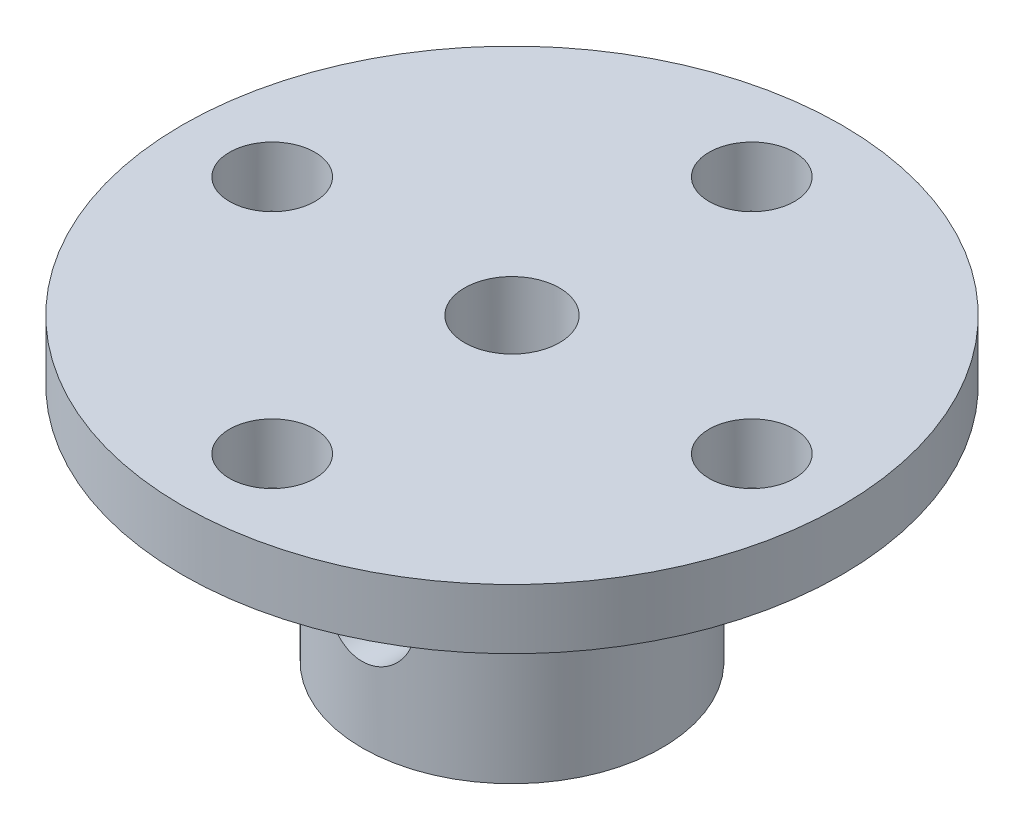
ISO-10303-21;
HEADER;
FILE_DESCRIPTION(('STEP AP214'),'2;1');
FILE_NAME('part.step','',(''),(''),'','','');
FILE_SCHEMA(('AUTOMOTIVE_DESIGN { 1 0 10303 214 1 1 1 1 }'));
ENDSEC;
DATA;
#1=APPLICATION_CONTEXT('core data for automotive mechanical design processes');
#2=APPLICATION_PROTOCOL_DEFINITION('international standard','automotive_design',2000,#1);
#3=PRODUCT_CONTEXT('',#1,'mechanical');
#4=PRODUCT('Part','Part','',(#3));
#5=PRODUCT_RELATED_PRODUCT_CATEGORY('part','',(#4));
#6=PRODUCT_DEFINITION_FORMATION('','',#4);
#7=PRODUCT_DEFINITION_CONTEXT('part definition',#1,'design');
#8=PRODUCT_DEFINITION('design','',#6,#7);
#9=PRODUCT_DEFINITION_SHAPE('','',#8);
#10=(LENGTH_UNIT() NAMED_UNIT(*) SI_UNIT(.MILLI.,.METRE.));
#11=(NAMED_UNIT(*) PLANE_ANGLE_UNIT() SI_UNIT($,.RADIAN.));
#12=(NAMED_UNIT(*) SI_UNIT($,.STERADIAN.) SOLID_ANGLE_UNIT());
#13=UNCERTAINTY_MEASURE_WITH_UNIT(LENGTH_MEASURE(1.E-05),#10,'distance_accuracy_value','');
#14=(GEOMETRIC_REPRESENTATION_CONTEXT(3) GLOBAL_UNCERTAINTY_ASSIGNED_CONTEXT((#13)) GLOBAL_UNIT_ASSIGNED_CONTEXT((#10,
#11,#12)) REPRESENTATION_CONTEXT('',''));
#15=CARTESIAN_POINT('',(0.,0.,0.));
#16=DIRECTION('',(0.,0.,1.));
#17=DIRECTION('',(1.,0.,0.));
#18=AXIS2_PLACEMENT_3D('',#15,#16,#17);
#19=CARTESIAN_POINT('',(0.,2.,0.));
#20=DIRECTION('',(0.,-1.,0.));
#21=DIRECTION('',(0.,0.,-1.));
#22=AXIS2_PLACEMENT_3D('',#19,#20,#21);
#23=CYLINDRICAL_SURFACE('',#22,11.);
#24=CARTESIAN_POINT('',(0.,2.,0.));
#25=DIRECTION('',(0.,1.,0.));
#26=DIRECTION('',(0.,0.,1.));
#27=AXIS2_PLACEMENT_3D('',#24,#25,#26);
#28=CIRCLE('',#27,11.);
#29=CARTESIAN_POINT('',(0.,2.,11.));
#30=VERTEX_POINT('',#29);
#31=EDGE_CURVE('E10',#30,#30,#28,.T.);
#32=ORIENTED_EDGE('',*,*,#31,.F.);
#33=EDGE_LOOP('',(#32));
#34=FACE_BOUND('',#33,.T.);
#35=CARTESIAN_POINT('',(0.,0.,0.));
#36=DIRECTION('',(0.,1.,0.));
#37=DIRECTION('',(0.,0.,1.));
#38=AXIS2_PLACEMENT_3D('',#35,#36,#37);
#39=CIRCLE('',#38,11.);
#40=CARTESIAN_POINT('',(0.,0.,11.));
#41=VERTEX_POINT('',#40);
#42=EDGE_CURVE('E46',#41,#41,#39,.T.);
#43=ORIENTED_EDGE('',*,*,#42,.T.);
#44=EDGE_LOOP('',(#43));
#45=FACE_BOUND('',#44,.T.);
#46=ADVANCED_FACE('F34',(#34,#45),#23,.T.);
#47=CARTESIAN_POINT('',(0.,2.,0.));
#48=DIRECTION('',(0.,1.,0.));
#49=DIRECTION('',(0.,0.,1.));
#50=AXIS2_PLACEMENT_3D('',#47,#48,#49);
#51=PLANE('',#50);
#52=CARTESIAN_POINT('',(-8.,2.,0.));
#53=DIRECTION('',(0.,1.,0.));
#54=DIRECTION('',(1.,0.,0.));
#55=AXIS2_PLACEMENT_3D('',#52,#53,#54);
#56=CIRCLE('',#55,1.425);
#57=CARTESIAN_POINT('',(-6.575,2.,0.));
#58=VERTEX_POINT('',#57);
#59=EDGE_CURVE('E237',#58,#58,#56,.T.);
#60=ORIENTED_EDGE('',*,*,#59,.F.);
#61=EDGE_LOOP('',(#60));
#62=FACE_BOUND('',#61,.T.);
#63=CARTESIAN_POINT('',(0.,2.,8.));
#64=DIRECTION('',(0.,1.,0.));
#65=DIRECTION('',(0.,0.,-1.));
#66=AXIS2_PLACEMENT_3D('',#63,#64,#65);
#67=CIRCLE('',#66,1.425);
#68=CARTESIAN_POINT('',(0.,2.,6.575));
#69=VERTEX_POINT('',#68);
#70=EDGE_CURVE('E230',#69,#69,#67,.T.);
#71=ORIENTED_EDGE('',*,*,#70,.F.);
#72=EDGE_LOOP('',(#71));
#73=FACE_BOUND('',#72,.T.);
#74=CARTESIAN_POINT('',(8.,2.,0.));
#75=DIRECTION('',(0.,1.,0.));
#76=DIRECTION('',(-1.,0.,0.));
#77=AXIS2_PLACEMENT_3D('',#74,#75,#76);
#78=CIRCLE('',#77,1.425);
#79=CARTESIAN_POINT('',(6.575,2.,0.));
#80=VERTEX_POINT('',#79);
#81=EDGE_CURVE('E231',#80,#80,#78,.T.);
#82=ORIENTED_EDGE('',*,*,#81,.F.);
#83=EDGE_LOOP('',(#82));
#84=FACE_BOUND('',#83,.T.);
#85=CARTESIAN_POINT('',(0.,2.,-8.));
#86=DIRECTION('',(0.,1.,0.));
#87=DIRECTION('',(0.,0.,1.));
#88=AXIS2_PLACEMENT_3D('',#85,#86,#87);
#89=CIRCLE('',#88,1.425);
#90=CARTESIAN_POINT('',(0.,2.,-6.575));
#91=VERTEX_POINT('',#90);
#92=EDGE_CURVE('E208',#91,#91,#89,.T.);
#93=ORIENTED_EDGE('',*,*,#92,.F.);
#94=EDGE_LOOP('',(#93));
#95=FACE_BOUND('',#94,.T.);
#96=CARTESIAN_POINT('',(0.,2.,0.));
#97=DIRECTION('',(0.,-1.,0.));
#98=DIRECTION('',(0.,0.,-1.));
#99=AXIS2_PLACEMENT_3D('',#96,#97,#98);
#100=CIRCLE('',#99,1.585);
#101=CARTESIAN_POINT('',(0.,2.,-1.585));
#102=VERTEX_POINT('',#101);
#103=EDGE_CURVE('E202',#102,#102,#100,.T.);
#104=ORIENTED_EDGE('',*,*,#103,.T.);
#105=EDGE_LOOP('',(#104));
#106=FACE_BOUND('',#105,.T.);
#107=ORIENTED_EDGE('',*,*,#31,.T.);
#108=EDGE_LOOP('',(#107));
#109=FACE_BOUND('',#108,.T.);
#110=ADVANCED_FACE('F96',(#62,#73,#84,#95,#106,#109),#51,.T.);
#111=CARTESIAN_POINT('',(0.,0.,0.));
#112=DIRECTION('',(0.,1.,0.));
#113=DIRECTION('',(0.,0.,1.));
#114=AXIS2_PLACEMENT_3D('',#111,#112,#113);
#115=PLANE('',#114);
#116=CARTESIAN_POINT('',(-8.,0.,0.));
#117=DIRECTION('',(0.,1.,0.));
#118=DIRECTION('',(0.,0.,1.));
#119=AXIS2_PLACEMENT_3D('',#116,#117,#118);
#120=CIRCLE('',#119,1.425);
#121=CARTESIAN_POINT('',(-8.,0.,1.42500000000003));
#122=VERTEX_POINT('',#121);
#123=EDGE_CURVE('E226',#122,#122,#120,.F.);
#124=ORIENTED_EDGE('',*,*,#123,.F.);
#125=EDGE_LOOP('',(#124));
#126=FACE_BOUND('',#125,.T.);
#127=CARTESIAN_POINT('',(0.,0.,8.));
#128=DIRECTION('',(0.,1.,0.));
#129=DIRECTION('',(0.,0.,1.));
#130=AXIS2_PLACEMENT_3D('',#127,#128,#129);
#131=CIRCLE('',#130,1.425);
#132=CARTESIAN_POINT('',(0.,0.,9.425));
#133=VERTEX_POINT('',#132);
#134=EDGE_CURVE('E234',#133,#133,#131,.F.);
#135=ORIENTED_EDGE('',*,*,#134,.F.);
#136=EDGE_LOOP('',(#135));
#137=FACE_BOUND('',#136,.T.);
#138=CARTESIAN_POINT('',(8.,0.,0.));
#139=DIRECTION('',(0.,1.,0.));
#140=DIRECTION('',(0.,0.,1.));
#141=AXIS2_PLACEMENT_3D('',#138,#139,#140);
#142=CIRCLE('',#141,1.425);
#143=CARTESIAN_POINT('',(8.,0.,1.42499999999992));
#144=VERTEX_POINT('',#143);
#145=EDGE_CURVE('E227',#144,#144,#142,.F.);
#146=ORIENTED_EDGE('',*,*,#145,.F.);
#147=EDGE_LOOP('',(#146));
#148=FACE_BOUND('',#147,.T.);
#149=CARTESIAN_POINT('',(0.,0.,-8.));
#150=DIRECTION('',(0.,1.,0.));
#151=DIRECTION('',(0.,0.,1.));
#152=AXIS2_PLACEMENT_3D('',#149,#150,#151);
#153=CIRCLE('',#152,1.425);
#154=CARTESIAN_POINT('',(0.,0.,-6.575));
#155=VERTEX_POINT('',#154);
#156=EDGE_CURVE('E204',#155,#155,#153,.F.);
#157=ORIENTED_EDGE('',*,*,#156,.F.);
#158=EDGE_LOOP('',(#157));
#159=FACE_BOUND('',#158,.T.);
#160=CARTESIAN_POINT('',(0.,0.,0.));
#161=DIRECTION('',(0.,1.,0.));
#162=DIRECTION('',(0.,0.,1.));
#163=AXIS2_PLACEMENT_3D('',#160,#161,#162);
#164=CIRCLE('',#163,5.);
#165=CARTESIAN_POINT('',(0.,0.,5.));
#166=VERTEX_POINT('',#165);
#167=EDGE_CURVE('E54',#166,#166,#164,.T.);
#168=ORIENTED_EDGE('',*,*,#167,.T.);
#169=EDGE_LOOP('',(#168));
#170=FACE_BOUND('',#169,.T.);
#171=ORIENTED_EDGE('',*,*,#42,.F.);
#172=EDGE_LOOP('',(#171));
#173=FACE_BOUND('',#172,.T.);
#174=ADVANCED_FACE('F94',(#126,#137,#148,#159,#170,#173),#115,.F.);
#175=CARTESIAN_POINT('',(0.,-8.,0.));
#176=DIRECTION('',(0.,1.,0.));
#177=DIRECTION('',(0.,0.,1.));
#178=AXIS2_PLACEMENT_3D('',#175,#176,#177);
#179=CYLINDRICAL_SURFACE('',#178,5.);
#180=CARTESIAN_POINT('',(0.,-5.5,5.));
#181=CARTESIAN_POINT('',(0.0822886127532999,-5.49999900251511,4.9999992925055));
#182=CARTESIAN_POINT('',(0.164587318351529,-5.49320613637603,4.99794915693954));
#183=CARTESIAN_POINT('',(0.326788125304881,-5.4662786457779,4.98997105593691));
#184=CARTESIAN_POINT('',(0.40668950441142,-5.44614004197666,4.98404193389692));
#185=CARTESIAN_POINT('',(0.561732707754526,-5.39325398308974,4.96895552501836));
#186=CARTESIAN_POINT('',(0.636881364395373,-5.36052513038106,4.95980300250425));
#187=CARTESIAN_POINT('',(0.780624181053131,-5.28346390694416,4.93922109237645));
#188=CARTESIAN_POINT('',(0.849217467469669,-5.23912999260458,4.92779140192067));
#189=CARTESIAN_POINT('',(0.979871797183745,-5.13877599252733,4.90350737192774));
#190=CARTESIAN_POINT('',(1.04171807124434,-5.08248337411409,4.89062383657036));
#191=CARTESIAN_POINT('',(1.15524920923324,-4.96039077008982,4.86505834210442));
#192=CARTESIAN_POINT('',(1.20693236327441,-4.89458918787504,4.85237641724501));
#193=CARTESIAN_POINT('',(1.29980037723708,-4.75352924696239,4.82834113993772));
#194=CARTESIAN_POINT('',(1.34072309022214,-4.67809153900926,4.81702406663875));
#195=CARTESIAN_POINT('',(1.4092139477476,-4.52101074576971,4.79743620394031));
#196=CARTESIAN_POINT('',(1.43678529919973,-4.43936915607203,4.78916468313311));
#197=CARTESIAN_POINT('',(1.47701633682652,-4.27460973386954,4.77690870838434));
#198=CARTESIAN_POINT('',(1.49007196234677,-4.19159725613606,4.77281069324533));
#199=CARTESIAN_POINT('',(1.50213730614672,-4.02446684378323,4.76902789749767));
#200=CARTESIAN_POINT('',(1.50115042761078,-3.94034918194091,4.76934204760571));
#201=CARTESIAN_POINT('',(1.48546977199812,-3.77661609139152,4.77424744067778));
#202=CARTESIAN_POINT('',(1.47127205262685,-3.69694774963776,4.7786838859914));
#203=CARTESIAN_POINT('',(1.43037420427056,-3.54118021372654,4.79108356228624));
#204=CARTESIAN_POINT('',(1.40367284141641,-3.46508137262567,4.79904714132351));
#205=CARTESIAN_POINT('',(1.33816026653682,-3.31739965033926,4.81772733074973));
#206=CARTESIAN_POINT('',(1.29918816934643,-3.24589291604474,4.82848016115952));
#207=CARTESIAN_POINT('',(1.21035222588683,-3.11026797798981,4.85150987000065));
#208=CARTESIAN_POINT('',(1.16048574002588,-3.04615157058622,4.86378711746991));
#209=CARTESIAN_POINT('',(1.04881290765546,-2.92431380923798,4.88911011297937));
#210=CARTESIAN_POINT('',(0.986594907466973,-2.86697133597033,4.90216654310498));
#211=CARTESIAN_POINT('',(0.853263259313967,-2.76344601593575,4.92712244063259));
#212=CARTESIAN_POINT('',(0.782149051860888,-2.71726387158557,4.9390218351841));
#213=CARTESIAN_POINT('',(0.632355038342803,-2.63714007753527,4.9604316006947));
#214=CARTESIAN_POINT('',(0.55362774974795,-2.60328248375014,4.96992543668314));
#215=CARTESIAN_POINT('',(0.391245415603519,-2.54940040990037,4.98533521832222));
#216=CARTESIAN_POINT('',(0.307591751589581,-2.52937207146751,4.99125216186999));
#217=CARTESIAN_POINT('',(0.140952242668331,-2.50434782210061,4.99868364643538));
#218=CARTESIAN_POINT('',(0.0580500976011868,-2.49883841419839,5.0003485041779));
#219=CARTESIAN_POINT('',(-0.107499605823383,-2.50156915571208,4.9995292324176));
#220=CARTESIAN_POINT('',(-0.190147196690781,-2.50980746965144,4.99704565677756));
#221=CARTESIAN_POINT('',(-0.350903605309697,-2.5393846111115,4.98830696987163));
#222=CARTESIAN_POINT('',(-0.42907277261417,-2.56042338758087,4.98213829799417));
#223=CARTESIAN_POINT('',(-0.580754638954523,-2.6146432327782,4.96674347841533));
#224=CARTESIAN_POINT('',(-0.654266777025584,-2.64782576103786,4.95751696321085));
#225=CARTESIAN_POINT('',(-0.796437189461053,-2.72625316548113,4.93669654351325));
#226=CARTESIAN_POINT('',(-0.86494382619967,-2.77175934094797,4.92505280829675));
#227=CARTESIAN_POINT('',(-0.993523307980147,-2.87322475405281,4.90073468764318));
#228=CARTESIAN_POINT('',(-1.05359403235594,-2.92918661188767,4.8880600443108));
#229=CARTESIAN_POINT('',(-1.16585744551027,-3.05238730836935,4.86253171869138));
#230=CARTESIAN_POINT('',(-1.21768481231504,-3.11996187577174,4.84968825033268));
#231=CARTESIAN_POINT('',(-1.30928995072154,-3.26312793901353,4.82576515238463));
#232=CARTESIAN_POINT('',(-1.34906803829472,-3.33871922455821,4.81468547654651));
#233=CARTESIAN_POINT('',(-1.41517347127168,-3.49553249125469,4.79567189615055));
#234=CARTESIAN_POINT('',(-1.4415634693705,-3.57672618653659,4.78772337843827));
#235=CARTESIAN_POINT('',(-1.48021730815114,-3.74268796893148,4.77591594362794));
#236=CARTESIAN_POINT('',(-1.49248598978779,-3.82745482078767,4.772055625083));
#237=CARTESIAN_POINT('',(-1.50221984485059,-3.99436151837623,4.76899972496087));
#238=CARTESIAN_POINT('',(-1.5002805530849,-4.07646365101759,4.76961647442754));
#239=CARTESIAN_POINT('',(-1.48307505444813,-4.2391141033728,4.77499401288294));
#240=CARTESIAN_POINT('',(-1.46780938124716,-4.31966248517635,4.77975463592551));
#241=CARTESIAN_POINT('',(-1.42476888804136,-4.47594539914285,4.79275763670386));
#242=CARTESIAN_POINT('',(-1.39715175507069,-4.55172728736169,4.80095604545965));
#243=CARTESIAN_POINT('',(-1.33031507121129,-4.69764243881772,4.81990278909136));
#244=CARTESIAN_POINT('',(-1.29109329962876,-4.76777461764076,4.83065161194312));
#245=CARTESIAN_POINT('',(-1.20048763805072,-4.90316311652711,4.85397676425833));
#246=CARTESIAN_POINT('',(-1.14871276092994,-4.96814876126041,4.86660540163798));
#247=CARTESIAN_POINT('',(-1.03517434629782,-5.08870249830786,4.89201320450026));
#248=CARTESIAN_POINT('',(-0.973408217134502,-5.14426813946776,4.90479240823905));
#249=CARTESIAN_POINT('',(-0.839465762183248,-5.24602341229503,4.92950936570649));
#250=CARTESIAN_POINT('',(-0.767037885790607,-5.29189144685549,4.94141159765674));
#251=CARTESIAN_POINT('',(-0.615141373983529,-5.37073516990403,4.96260680455813));
#252=CARTESIAN_POINT('',(-0.535676052998954,-5.40371688827451,4.97190099931066));
#253=CARTESIAN_POINT('',(-0.38075771265528,-5.45289527565275,4.98602174969301));
#254=CARTESIAN_POINT('',(-0.305786961954233,-5.47051167288325,4.99122027381068));
#255=CARTESIAN_POINT('',(-0.153880195230778,-5.49406352524158,4.99820944494492));
#256=CARTESIAN_POINT('',(-0.0769445098581391,-5.50000093270482,5.0000006615474));
#257=CARTESIAN_POINT('',(0.,-5.5,5.));
#258=B_SPLINE_CURVE_WITH_KNOTS('',3,(#180,#181,#182,#183,#184,#185,#186,#187,#188,#189,#190,
#191,#192,#193,#194,#195,#196,#197,#198,#199,#200,#201,#202,#203,#204,#205,#206,#207,#208,#209,
#210,#211,#212,#213,#214,#215,#216,#217,#218,#219,#220,#221,#222,#223,#224,#225,#226,#227,#228,
#229,#230,#231,#232,#233,#234,#235,#236,#237,#238,#239,#240,#241,#242,#243,#244,#245,#246,#247,
#248,#249,#250,#251,#252,#253,#254,#255,#256,#257),.UNSPECIFIED.,.T.,.F.,(4,2,2,2,2,2,2,2,2,2,2,
2,2,2,2,2,2,2,2,2,2,2,2,2,2,2,2,2,2,2,2,2,2,2,2,2,2,2,4),(0.,0.246583203612611,0.493239964846,
0.739533676300874,0.985860164412702,1.23855602948191,1.49129437288633,1.74971481004109,
2.00807314543224,2.25919689356599,2.51025978319089,2.75226016697676,2.99428443658001,
3.2396242644712,3.48502360158556,3.74067104048167,3.99633456531072,4.25371046881689,
4.51101453528808,4.75908809438545,5.00712853550327,5.24956746682327,5.49203554593729,
5.74011305702909,5.98825282000191,6.24540400322819,6.50254844252681,6.75847814951252,
7.01432009460283,7.25950155466943,7.504673196616,7.74680040402721,7.98897397553107,
8.23996925679931,8.49102974897503,8.74942996156671,9.00770911595236,9.2383169193046,
9.46888616948875),.UNSPECIFIED.);
#259=CARTESIAN_POINT('',(0.,-5.5,5.));
#260=VERTEX_POINT('',#259);
#261=EDGE_CURVE('E84',#260,#260,#258,.T.);
#262=ORIENTED_EDGE('',*,*,#261,.F.);
#263=EDGE_LOOP('',(#262));
#264=FACE_BOUND('',#263,.T.);
#265=CARTESIAN_POINT('',(1.5,-4.,-4.76969600708473));
#266=CARTESIAN_POINT('',(1.49999897633764,-4.0821945479424,-4.7696968572698));
#267=CARTESIAN_POINT('',(1.49322108167142,-4.16439922414402,-4.77184390209069));
#268=CARTESIAN_POINT('',(1.46635844446749,-4.32640524959194,-4.780165783029));
#269=CARTESIAN_POINT('',(1.44626925573578,-4.40620578650147,-4.78634196493468));
#270=CARTESIAN_POINT('',(1.39352753269955,-4.56103472827173,-4.80196102485632));
#271=CARTESIAN_POINT('',(1.36089589394243,-4.63607082963309,-4.81139846703232));
#272=CARTESIAN_POINT('',(1.28406421917929,-4.7796219339953,-4.83246932547567));
#273=CARTESIAN_POINT('',(1.23986245137053,-4.84813595868444,-4.84410307041019));
#274=CARTESIAN_POINT('',(1.13964754141627,-4.97886639057737,-4.86866862185765));
#275=CARTESIAN_POINT('',(1.08333207175807,-5.04084589794629,-4.88162808311636));
#276=CARTESIAN_POINT('',(0.961136237579599,-5.15463795132251,-4.90714861936757));
#277=CARTESIAN_POINT('',(0.895254645461112,-5.20644919044988,-4.91970964297705));
#278=CARTESIAN_POINT('',(0.75411143779369,-5.29946269983331,-4.94333214579389));
#279=CARTESIAN_POINT('',(0.678684021335815,-5.34042342444281,-4.95435724342404));
#280=CARTESIAN_POINT('',(0.521624645369354,-5.40898725904276,-4.97334435920684));
#281=CARTESIAN_POINT('',(0.439994028387912,-5.43659324985745,-4.98130703789495));
#282=CARTESIAN_POINT('',(0.27532385263083,-5.47688000109051,-4.99307646003589));
#283=CARTESIAN_POINT('',(0.192391398953801,-5.4899651276527,-4.99699557369338));
#284=CARTESIAN_POINT('',(0.0254218237493148,-5.50211732464644,-5.00063201501348));
#285=CARTESIAN_POINT('',(-0.0586150620503685,-5.50118733940196,-5.00035022521079));
#286=CARTESIAN_POINT('',(-0.22257115660016,-5.48560713145698,-4.99569603817659));
#287=CARTESIAN_POINT('',(-0.302536267641342,-5.47139480619013,-4.9914542020526));
#288=CARTESIAN_POINT('',(-0.458889213442527,-5.43036866400571,-4.97951522112593));
#289=CARTESIAN_POINT('',(-0.535276821322846,-5.40355404905733,-4.97181785750586));
#290=CARTESIAN_POINT('',(-0.683347326351281,-5.33778797658144,-4.95365220986963));
#291=CARTESIAN_POINT('',(-0.754965064694478,-5.29869879719273,-4.94315269676706));
#292=CARTESIAN_POINT('',(-0.890764673783156,-5.20960214757177,-4.92049640648069));
#293=CARTESIAN_POINT('',(-0.954944774872131,-5.15959208703652,-4.90833923637778));
#294=CARTESIAN_POINT('',(-1.0766604815298,-5.0478022492484,-4.88311550488165));
#295=CARTESIAN_POINT('',(-1.13384458040111,-4.98564308097026,-4.87003195321461));
#296=CARTESIAN_POINT('',(-1.23707651539824,-4.85248998210995,-4.84483979887497));
#297=CARTESIAN_POINT('',(-1.28312324482853,-4.78149517461077,-4.8327312931702));
#298=CARTESIAN_POINT('',(-1.3631399533545,-4.63176053075101,-4.81077903197678));
#299=CARTESIAN_POINT('',(-1.39698989237679,-4.55295295413708,-4.80095810695957));
#300=CARTESIAN_POINT('',(-1.45083362878413,-4.39039279155446,-4.78496392548436));
#301=CARTESIAN_POINT('',(-1.4708319464056,-4.30664182846544,-4.7787894791583));
#302=CARTESIAN_POINT('',(-1.49574770282165,-4.13991763926072,-4.77104849541241));
#303=CARTESIAN_POINT('',(-1.50119946380212,-4.05703177610602,-4.7693187867044));
#304=CARTESIAN_POINT('',(-1.49835947233062,-3.89152709999013,-4.77021192441924));
#305=CARTESIAN_POINT('',(-1.4900696437133,-3.80890825126915,-4.77283416156589));
#306=CARTESIAN_POINT('',(-1.4604576357419,-3.64851162202913,-4.78197558554912));
#307=CARTESIAN_POINT('',(-1.4394796143128,-3.57066383573648,-4.78839176507489));
#308=CARTESIAN_POINT('',(-1.3854857774794,-3.41959830918508,-4.80429141231227));
#309=CARTESIAN_POINT('',(-1.3524681034276,-3.34638128585943,-4.81377535359073));
#310=CARTESIAN_POINT('',(-1.274318711965,-3.20448253592787,-4.83505835023047));
#311=CARTESIAN_POINT('',(-1.22888564172729,-3.13597527901421,-4.84691271069799));
#312=CARTESIAN_POINT('',(-1.12755301600385,-3.0073618938192,-4.87148205646987));
#313=CARTESIAN_POINT('',(-1.07165095534897,-2.94725778238721,-4.88419724730003));
#314=CARTESIAN_POINT('',(-0.9484551324936,-2.83481959418526,-4.90963633548158));
#315=CARTESIAN_POINT('',(-0.880811065857435,-2.78286437101302,-4.92234245063004));
#316=CARTESIAN_POINT('',(-0.73746178459025,-2.69103329897225,-4.94584851748651));
#317=CARTESIAN_POINT('',(-0.661756970543945,-2.65115685021854,-4.95664856384717));
#318=CARTESIAN_POINT('',(-0.504935504705223,-2.5849999694317,-4.97505970474957));
#319=CARTESIAN_POINT('',(-0.42386462203784,-2.55861798384102,-4.98269453424966));
#320=CARTESIAN_POINT('',(-0.258169966504589,-2.51993908110958,-4.99401979596827));
#321=CARTESIAN_POINT('',(-0.173547217354764,-2.50763813405158,-4.9977113567088));
#322=CARTESIAN_POINT('',(-0.00665215388274386,-2.4977769559455,-5.00066544081399));
#323=CARTESIAN_POINT('',(0.0755851790862056,-2.49966730459217,-5.00009305111322));
#324=CARTESIAN_POINT('',(0.238519481164403,-2.51682163249912,-4.99497264465037));
#325=CARTESIAN_POINT('',(0.319216537346528,-2.53208485348044,-4.99042485330462));
#326=CARTESIAN_POINT('',(0.475935813041357,-2.57521166139962,-4.97791168358327));
#327=CARTESIAN_POINT('',(0.551998927351391,-2.60293818064901,-4.96998352900866));
#328=CARTESIAN_POINT('',(0.698433237752052,-2.67008191450719,-4.9515294303945));
#329=CARTESIAN_POINT('',(0.768803496050579,-2.70950105028619,-4.94100305949946));
#330=CARTESIAN_POINT('',(0.904301892420563,-2.80037345743003,-4.91803965828228));
#331=CARTESIAN_POINT('',(0.969190250076767,-2.85217143000077,-4.90555226923559));
#332=CARTESIAN_POINT('',(1.08953757134594,-2.9657103883328,-4.88023537212334));
#333=CARTESIAN_POINT('',(1.14499380960194,-3.02745423789815,-4.86740576641079));
#334=CARTESIAN_POINT('',(1.24656269394549,-3.16134077831051,-4.84240680631319));
#335=CARTESIAN_POINT('',(1.29234759757956,-3.23373855339044,-4.83026852693485));
#336=CARTESIAN_POINT('',(1.37104313528776,-3.38555517416102,-4.80852547508793));
#337=CARTESIAN_POINT('',(1.40395995557289,-3.46497062360119,-4.79891948596955));
#338=CARTESIAN_POINT('',(1.4530194253295,-3.61974043160627,-4.78427816717595));
#339=CARTESIAN_POINT('',(1.47058859011232,-3.69460864693099,-4.7788615484052));
#340=CARTESIAN_POINT('',(1.49407818835144,-3.84631522249577,-4.77157042597167));
#341=CARTESIAN_POINT('',(1.50000095706095,-3.92315318464525,-4.7696952122143));
#342=CARTESIAN_POINT('',(1.5,-4.,-4.76969600708473));
#343=B_SPLINE_CURVE_WITH_KNOTS('',3,(#265,#266,#267,#268,#269,#270,#271,#272,#273,#274,#275,
#276,#277,#278,#279,#280,#281,#282,#283,#284,#285,#286,#287,#288,#289,#290,#291,#292,#293,#294,
#295,#296,#297,#298,#299,#300,#301,#302,#303,#304,#305,#306,#307,#308,#309,#310,#311,#312,#313,
#314,#315,#316,#317,#318,#319,#320,#321,#322,#323,#324,#325,#326,#327,#328,#329,#330,#331,#332,
#333,#334,#335,#336,#337,#338,#339,#340,#341,#342),.UNSPECIFIED.,.T.,.F.,(4,2,2,2,2,2,2,2,2,2,2,
2,2,2,2,2,2,2,2,2,2,2,2,2,2,2,2,2,2,2,2,2,2,2,2,2,2,2,4),(0.,0.246300165915543,0.492682641689,
0.738656414466192,0.984667025370101,1.23773150007984,1.49082847871273,1.74915939273645,
2.00743455587877,2.25832140149558,2.5091555410144,2.7520012599088,2.99486235890376,
3.24055209335676,3.48630016590831,3.74152147023278,3.99676812491863,4.25446238246266,
4.51207250628411,4.76008080790309,5.00805439107388,5.24958594938817,5.49115481045787,
5.73920731809389,5.98731925928923,6.24479506100602,6.50225807324202,6.75775391814325,
7.01317662321682,7.2587630391122,7.50433553047755,7.74727096872219,7.99024634491378,
8.24099627054489,8.49181852629891,8.75011639669147,9.00828993963944,9.23861153857448,
9.46888695033561),.UNSPECIFIED.);
#344=CARTESIAN_POINT('',(1.5,-4.,-4.76969600708473));
#345=VERTEX_POINT('',#344);
#346=EDGE_CURVE('E78',#345,#345,#343,.T.);
#347=ORIENTED_EDGE('',*,*,#346,.F.);
#348=EDGE_LOOP('',(#347));
#349=FACE_BOUND('',#348,.T.);
#350=CARTESIAN_POINT('',(0.,-8.,0.));
#351=DIRECTION('',(0.,1.,0.));
#352=DIRECTION('',(0.,0.,1.));
#353=AXIS2_PLACEMENT_3D('',#350,#351,#352);
#354=CIRCLE('',#353,5.);
#355=CARTESIAN_POINT('',(0.,-8.,5.));
#356=VERTEX_POINT('',#355);
#357=EDGE_CURVE('E51',#356,#356,#354,.T.);
#358=ORIENTED_EDGE('',*,*,#357,.T.);
#359=EDGE_LOOP('',(#358));
#360=FACE_BOUND('',#359,.T.);
#361=ORIENTED_EDGE('',*,*,#167,.F.);
#362=EDGE_LOOP('',(#361));
#363=FACE_BOUND('',#362,.T.);
#364=ADVANCED_FACE('F89',(#264,#349,#360,#363),#179,.T.);
#365=CARTESIAN_POINT('',(0.,-8.,0.));
#366=DIRECTION('',(0.,1.,0.));
#367=DIRECTION('',(0.,0.,1.));
#368=AXIS2_PLACEMENT_3D('',#365,#366,#367);
#369=PLANE('',#368);
#370=CARTESIAN_POINT('',(0.,-8.,0.));
#371=DIRECTION('',(0.,-1.,0.));
#372=DIRECTION('',(0.,0.,-1.));
#373=AXIS2_PLACEMENT_3D('',#370,#371,#372);
#374=CIRCLE('',#373,1.585);
#375=CARTESIAN_POINT('',(0.,-8.,-1.585));
#376=VERTEX_POINT('',#375);
#377=EDGE_CURVE('E199',#376,#376,#374,.T.);
#378=ORIENTED_EDGE('',*,*,#377,.F.);
#379=EDGE_LOOP('',(#378));
#380=FACE_BOUND('',#379,.T.);
#381=ORIENTED_EDGE('',*,*,#357,.F.);
#382=EDGE_LOOP('',(#381));
#383=FACE_BOUND('',#382,.T.);
#384=ADVANCED_FACE('F93',(#380,#383),#369,.F.);
#385=CARTESIAN_POINT('',(0.,-8.,0.));
#386=DIRECTION('',(0.,1.,0.));
#387=DIRECTION('',(0.,0.,1.));
#388=AXIS2_PLACEMENT_3D('',#385,#386,#387);
#389=CYLINDRICAL_SURFACE('',#388,1.585);
#390=CARTESIAN_POINT('',(0.,-5.5,1.585));
#391=CARTESIAN_POINT('',(-0.0683262612861184,-5.49999739604472,1.58499741307662));
#392=CARTESIAN_POINT('',(-0.136670878290201,-5.49529481023606,1.58054493726738));
#393=CARTESIAN_POINT('',(-0.271023398948482,-5.47687365629956,1.56312893170465));
#394=CARTESIAN_POINT('',(-0.337029452166831,-5.46314810938734,1.55015881401248));
#395=CARTESIAN_POINT('',(-0.464406492854596,-5.42782068006887,1.51685936980566));
#396=CARTESIAN_POINT('',(-0.525804216139194,-5.40626929095585,1.49657722726852));
#397=CARTESIAN_POINT('',(-0.643328147726754,-5.35654259558143,1.44995115722477));
#398=CARTESIAN_POINT('',(-0.699452997195946,-5.32836558839782,1.42360567317999));
#399=CARTESIAN_POINT('',(-0.827609864265042,-5.2540182087681,1.35444823904473));
#400=CARTESIAN_POINT('',(-0.896832275807209,-5.20518984217785,1.3092963364636));
#401=CARTESIAN_POINT('',(-1.02383295717362,-5.09938067156862,1.21259683926593));
#402=CARTESIAN_POINT('',(-1.08157369305156,-5.04237414533153,1.16102913608875));
#403=CARTESIAN_POINT('',(-1.16752083104702,-4.94316380331327,1.07306154551757));
#404=CARTESIAN_POINT('',(-1.19897800140824,-4.90279223184899,1.03769489672312));
#405=CARTESIAN_POINT('',(-1.25736684506734,-4.81952307035271,0.966118965197951));
#406=CARTESIAN_POINT('',(-1.28429519261906,-4.77662365494333,0.929909085262265));
#407=CARTESIAN_POINT('',(-1.3336532590803,-4.68841761087906,0.857615995523264));
#408=CARTESIAN_POINT('',(-1.35609316959775,-4.64311673814022,0.821532685812609));
#409=CARTESIAN_POINT('',(-1.39657689192204,-4.54969821781175,0.750633833042449));
#410=CARTESIAN_POINT('',(-1.41462618173623,-4.50158417409029,0.715816756785991));
#411=CARTESIAN_POINT('',(-1.44109457234763,-4.41773565109531,0.660371787339285));
#412=CARTESIAN_POINT('',(-1.4507411213745,-4.38302261697073,0.638793376104437));
#413=CARTESIAN_POINT('',(-1.46779016360757,-4.3113657019988,0.598572836958073));
#414=CARTESIAN_POINT('',(-1.47519430457433,-4.27442348325134,0.579928557858209));
#415=CARTESIAN_POINT('',(-1.48599809573699,-4.20663816536733,0.551554255559188));
#416=CARTESIAN_POINT('',(-1.48992677086483,-4.17634057744656,0.540760425825194));
#417=CARTESIAN_POINT('',(-1.49595840203572,-4.11433067091175,0.523847351825189));
#418=CARTESIAN_POINT('',(-1.49806781700831,-4.08262378102701,0.517711579404808));
#419=CARTESIAN_POINT('',(-1.50023929969532,-4.01814552787986,0.5113921642805));
#420=CARTESIAN_POINT('',(-1.50027820695366,-3.98536622566076,0.511275854979331));
#421=CARTESIAN_POINT('',(-1.49824198534042,-3.92041763902206,0.517206835366781));
#422=CARTESIAN_POINT('',(-1.49616242539463,-3.88824977716516,0.523267044130403));
#423=CARTESIAN_POINT('',(-1.48917581675137,-3.81533500300562,0.542875849392505));
#424=CARTESIAN_POINT('',(-1.48357378194499,-3.77516216772318,0.558207725832199));
#425=CARTESIAN_POINT('',(-1.46971152217967,-3.69748026559184,0.593749704576324));
#426=CARTESIAN_POINT('',(-1.46143921106146,-3.65998427540097,0.613981880540936));
#427=CARTESIAN_POINT('',(-1.44139178040863,-3.58265596427207,0.65978456263672));
#428=CARTESIAN_POINT('',(-1.42930822812276,-3.54311667614243,0.685706200118766));
#429=CARTESIAN_POINT('',(-1.40237948908865,-3.46615396354457,0.73923053084955));
#430=CARTESIAN_POINT('',(-1.38753135118155,-3.42873285639875,0.766834999118376));
#431=CARTESIAN_POINT('',(-1.33889989005076,-3.31899053222774,0.850724422538774));
#432=CARTESIAN_POINT('',(-1.3010420592796,-3.24923683292106,0.908054494973795));
#433=CARTESIAN_POINT('',(-1.20745464988308,-3.10528623018158,1.03010979537361));
#434=CARTESIAN_POINT('',(-1.14985890098547,-3.03209224454652,1.09459437234667));
#435=CARTESIAN_POINT('',(-1.01898137501235,-2.89519646658286,1.21733815483717));
#436=CARTESIAN_POINT('',(-0.945744030223142,-2.83146863599618,1.27561430776111));
#437=CARTESIAN_POINT('',(-0.809828136009726,-2.73562506586324,1.36405866849669));
#438=CARTESIAN_POINT('',(-0.75155379982734,-2.69999348661939,1.39717984748592));
#439=CARTESIAN_POINT('',(-0.627995728992671,-2.63601644095735,1.45689497824733));
#440=CARTESIAN_POINT('',(-0.562715284679618,-2.60766757534072,1.48349197491163));
#441=CARTESIAN_POINT('',(-0.425460060564104,-2.55975235132153,1.52855216058778));
#442=CARTESIAN_POINT('',(-0.353424001709793,-2.54027815512846,1.54692995942545));
#443=CARTESIAN_POINT('',(-0.205447358314495,-2.512237686279,1.57341663481618));
#444=CARTESIAN_POINT('',(-0.129511976414072,-2.50365725292358,1.58153884243971));
#445=CARTESIAN_POINT('',(0.0117085090738491,-2.49863565720254,1.586291260192));
#446=CARTESIAN_POINT('',(0.0768917193945288,-2.50057388729119,1.58445568191413));
#447=CARTESIAN_POINT('',(0.205755494951419,-2.51277070030979,1.57291831437922));
#448=CARTESIAN_POINT('',(0.269436053823407,-2.52302931847282,1.56321649181221));
#449=CARTESIAN_POINT('',(0.390871565370113,-2.55053932298896,1.53725128810713));
#450=CARTESIAN_POINT('',(0.44876324735246,-2.56747627868689,1.52128308409501));
#451=CARTESIAN_POINT('',(0.560478336580214,-2.60738099424329,1.48376790188896));
#452=CARTESIAN_POINT('',(0.614300646620574,-2.63035037317953,1.46221942599454));
#453=CARTESIAN_POINT('',(0.739714162938487,-2.69247434428393,1.40416318681989));
#454=CARTESIAN_POINT('',(0.808850929148322,-2.73432320408229,1.36522556349157));
#455=CARTESIAN_POINT('',(0.937049449325096,-2.82603911580146,1.2806640883226));
#456=CARTESIAN_POINT('',(0.996082599540299,-2.87592818020051,1.23502191202421));
#457=CARTESIAN_POINT('',(1.12277457351423,-3.00012978789577,1.12293109072237));
#458=CARTESIAN_POINT('',(1.18643601269366,-3.07694686140359,1.05471914565873));
#459=CARTESIAN_POINT('',(1.2690937319062,-3.19887262319904,0.950578599780403));
#460=CARTESIAN_POINT('',(1.29450895332027,-3.24063532445958,0.915558056526227));
#461=CARTESIAN_POINT('',(1.34120249945004,-3.32652653563128,0.845670250150798));
#462=CARTESIAN_POINT('',(1.36248343938469,-3.37065352727596,0.810802903856587));
#463=CARTESIAN_POINT('',(1.39840386804099,-3.45565862914711,0.746896489992753));
#464=CARTESIAN_POINT('',(1.41354866898862,-3.49620125814126,0.717693800368342));
#465=CARTESIAN_POINT('',(1.44065535995967,-3.57993762629688,0.661588390413831));
#466=CARTESIAN_POINT('',(1.45261737511595,-3.62313126115051,0.63468557969104));
#467=CARTESIAN_POINT('',(1.47036443854125,-3.70135251014712,0.592148907648277));
#468=CARTESIAN_POINT('',(1.47694685468994,-3.73557990549124,0.575404415658258));
#469=CARTESIAN_POINT('',(1.48786352293523,-3.80627220934061,0.54655789114328));
#470=CARTESIAN_POINT('',(1.49220550711304,-3.84272893007194,0.534439929920225));
#471=CARTESIAN_POINT('',(1.49743645565276,-3.90800385346701,0.519573626235645));
#472=CARTESIAN_POINT('',(1.4989242438596,-3.93639358797507,0.515222350267201));
#473=CARTESIAN_POINT('',(1.50025710328688,-3.99352607407492,0.511330738306974));
#474=CARTESIAN_POINT('',(1.50010427872104,-4.02226832625885,0.511784239803946));
#475=CARTESIAN_POINT('',(1.49818244164299,-4.07910589980045,0.51737889492945));
#476=CARTESIAN_POINT('',(1.49641911179436,-4.10720313996855,0.522503566220837));
#477=CARTESIAN_POINT('',(1.49144901194564,-4.16232252646498,0.53652621416807));
#478=CARTESIAN_POINT('',(1.48823904809979,-4.18934214919929,0.545432537339054));
#479=CARTESIAN_POINT('',(1.47676201244689,-4.26834928132366,0.576071546375115));
#480=CARTESIAN_POINT('',(1.46663852851271,-4.31848473894499,0.601758317204593));
#481=CARTESIAN_POINT('',(1.44231833561816,-4.41497967588726,0.657952028465661));
#482=CARTESIAN_POINT('',(1.42810036425346,-4.46131777908918,0.68848374687017));
#483=CARTESIAN_POINT('',(1.39476467218737,-4.55428202376302,0.753854389616995));
#484=CARTESIAN_POINT('',(1.37537455145209,-4.60070321207427,0.788845199665778));
#485=CARTESIAN_POINT('',(1.33231819187755,-4.6909623819736,0.859578295537745));
#486=CARTESIAN_POINT('',(1.30864812828311,-4.7347980061328,0.895321228040465));
#487=CARTESIAN_POINT('',(1.2570061799534,-4.82000679959349,0.966483802836084));
#488=CARTESIAN_POINT('',(1.22904111831691,-4.8613837326864,1.0019038651171));
#489=CARTESIAN_POINT('',(1.16865997538917,-4.94167740511245,1.07172326330939));
#490=CARTESIAN_POINT('',(1.1362437042482,-4.98059403940728,1.1061225556074));
#491=CARTESIAN_POINT('',(1.0498674494135,-5.07404526063951,1.18960663893915));
#492=CARTESIAN_POINT('',(0.99310587523063,-5.12695138871953,1.23768095244605));
#493=CARTESIAN_POINT('',(0.869097456228177,-5.22511128503748,1.32768428462824));
#494=CARTESIAN_POINT('',(0.801868921846861,-5.27037813424127,1.36962379136318));
#495=CARTESIAN_POINT('',(0.672837222463148,-5.34219961708632,1.43652156696858));
#496=CARTESIAN_POINT('',(0.613005155108745,-5.3706838889297,1.46319074455851));
#497=CARTESIAN_POINT('',(0.487754562775724,-5.42007372912559,1.50955681966625));
#498=CARTESIAN_POINT('',(0.422342750452235,-5.44098824963161,1.52926195236169));
#499=CARTESIAN_POINT('',(0.297766872279874,-5.47132276206643,1.55788148752841));
#500=CARTESIAN_POINT('',(0.239188210535353,-5.48201553628646,1.56798905876264));
#501=CARTESIAN_POINT('',(0.120410891077717,-5.49635456951589,1.58154876244342));
#502=CARTESIAN_POINT('',(0.0602125730915844,-5.5000022947377,1.58500227972832));
#503=CARTESIAN_POINT('',(0.,-5.5,1.585));
#504=B_SPLINE_CURVE_WITH_KNOTS('',3,(#390,#391,#392,#393,#394,#395,#396,#397,#398,#399,#400,
#401,#402,#403,#404,#405,#406,#407,#408,#409,#410,#411,#412,#413,#414,#415,#416,#417,#418,#419,
#420,#421,#422,#423,#424,#425,#426,#427,#428,#429,#430,#431,#432,#433,#434,#435,#436,#437,#438,
#439,#440,#441,#442,#443,#444,#445,#446,#447,#448,#449,#450,#451,#452,#453,#454,#455,#456,#457,
#458,#459,#460,#461,#462,#463,#464,#465,#466,#467,#468,#469,#470,#471,#472,#473,#474,#475,#476,
#477,#478,#479,#480,#481,#482,#483,#484,#485,#486,#487,#488,#489,#490,#491,#492,#493,#494,#495,
#496,#497,#498,#499,#500,#501,#502,#503),.UNSPECIFIED.,.T.,.F.,(4,2,2,2,2,2,2,2,2,2,2,2,2,2,2,2,
2,2,2,2,2,2,2,2,2,2,2,2,2,2,2,2,2,2,2,2,2,2,2,2,2,2,2,2,2,2,2,2,2,2,2,2,2,2,2,2,4),(0.,
0.204718792052916,0.409596109880056,0.613174362497077,0.816804934692826,1.10322279854723,
1.39056211091135,1.5769913953665,1.76355699218465,1.94969403343291,2.13559763366784,
2.26145084839233,2.38721135833643,2.48411558576113,2.58067434037514,2.67831296544889,
2.77615623570389,2.90551502190256,3.03546771830409,3.18164970770259,3.32798864854774,
3.62083678519642,3.95934439502156,4.29690291786121,4.5238473851269,4.75068573306853,
4.97982889454358,5.20867388900424,5.40336483532651,5.59805660608099,5.78450595751008,
5.97100540241575,6.23862814749301,6.5069964420054,6.86750594116096,7.04779337307071,
7.22796638669426,7.38445410707325,7.54093567414741,7.65669380859399,7.77204972568091,
7.85793004736409,7.94370023401663,8.02916894510428,8.11482728355629,8.28555178865892,
8.45717935496029,8.64076699167159,8.82451950901415,9.00798307742387,9.19145447321918,
9.46431415007105,9.73670175315763,9.95018030413527,10.16340555936,10.3438517190673,
10.5242603203529),.UNSPECIFIED.);
#505=CARTESIAN_POINT('',(0.,-5.5,1.585));
#506=VERTEX_POINT('',#505);
#507=EDGE_CURVE('E37',#506,#506,#504,.T.);
#508=ORIENTED_EDGE('',*,*,#507,.F.);
#509=EDGE_LOOP('',(#508));
#510=FACE_BOUND('',#509,.T.);
#511=CARTESIAN_POINT('',(1.5,-4.,-0.512079095453035));
#512=CARTESIAN_POINT('',(1.49999591836726,-3.96236068106466,-0.512098484049653));
#513=CARTESIAN_POINT('',(1.49855420485369,-3.92465845343228,-0.516370450813465));
#514=CARTESIAN_POINT('',(1.49303983384172,-3.85091922046403,-0.532087938451793));
#515=CARTESIAN_POINT('',(1.48895063299488,-3.81489422342294,-0.543578552984394));
#516=CARTESIAN_POINT('',(1.47561047816396,-3.72488579680501,-0.579069093576744));
#517=CARTESIAN_POINT('',(1.46474221450217,-3.67255520673305,-0.606460654800737));
#518=CARTESIAN_POINT('',(1.43858337565573,-3.57199754293125,-0.666174675854992));
#519=CARTESIAN_POINT('',(1.42327546606163,-3.52378753192643,-0.698516224333365));
#520=CARTESIAN_POINT('',(1.38798847599479,-3.42893174153279,-0.766303419058245));
#521=CARTESIAN_POINT('',(1.36787860443871,-3.38238163652667,-0.801814416531475));
#522=CARTESIAN_POINT('',(1.32329086843972,-3.29187069979976,-0.873448809982126));
#523=CARTESIAN_POINT('',(1.29880937437827,-3.24791206034181,-0.909572692089348));
#524=CARTESIAN_POINT('',(1.24544588946214,-3.16250775358657,-0.981370235534637));
#525=CARTESIAN_POINT('',(1.21657162957491,-3.12105784681592,-1.01704457088693));
#526=CARTESIAN_POINT('',(1.15426175293482,-3.04069595812988,-1.08724843971678));
#527=CARTESIAN_POINT('',(1.12082609785452,-3.00178399754383,-1.12177796357194));
#528=CARTESIAN_POINT('',(1.03315963532998,-2.90994191910704,-1.20410492503551));
#529=CARTESIAN_POINT('',(0.976327182650649,-2.85855034925151,-1.25090863337373));
#530=CARTESIAN_POINT('',(0.852510974561911,-2.76335144632608,-1.33834822002032));
#531=CARTESIAN_POINT('',(0.785544979269101,-2.71953112610382,-1.37899464500243));
#532=CARTESIAN_POINT('',(0.656824905966354,-2.64990567060368,-1.44390342342051));
#533=CARTESIAN_POINT('',(0.596914170683222,-2.62224958094025,-1.46981436778028));
#534=CARTESIAN_POINT('',(0.471659325983355,-2.57451109761597,-1.51465387522977));
#535=CARTESIAN_POINT('',(0.40631835610227,-2.55442436434043,-1.53358643898315));
#536=CARTESIAN_POINT('',(0.271147979618017,-2.52306993965176,-1.56317631261677));
#537=CARTESIAN_POINT('',(0.201288260278604,-2.51187036716104,-1.57376969896746));
#538=CARTESIAN_POINT('',(0.0599083641498827,-2.49952187381216,-1.58545114450673));
#539=CARTESIAN_POINT('',(-0.0116107179824494,-2.49836650591401,-1.58654530093362));
#540=CARTESIAN_POINT('',(-0.144851987347325,-2.50570427575212,-1.57960247209387));
#541=CARTESIAN_POINT('',(-0.20670285252205,-2.51303498594034,-1.5726655726039));
#542=CARTESIAN_POINT('',(-0.327894287522029,-2.53498163025916,-1.55193134514607));
#543=CARTESIAN_POINT('',(-0.387234433159488,-2.54959879015058,-1.53813286289146));
#544=CARTESIAN_POINT('',(-0.503578437853039,-2.58571013898004,-1.50412861597782));
#545=CARTESIAN_POINT('',(-0.560485500408704,-2.60736862155978,-1.4837698945893));
#546=CARTESIAN_POINT('',(-0.669513606064337,-2.65637440884914,-1.43787385537925));
#547=CARTESIAN_POINT('',(-0.721633259534192,-2.68372335784256,-1.41233504080219));
#548=CARTESIAN_POINT('',(-0.846315667854421,-2.7584603218112,-1.34289461446776));
#549=CARTESIAN_POINT('',(-0.915557788179371,-2.80890861039111,-1.29631576998731));
#550=CARTESIAN_POINT('',(-1.04227777570907,-2.9180141485549,-1.196830848182));
#551=CARTESIAN_POINT('',(-1.09971233743559,-2.9767003329202,-1.14390256873408));
#552=CARTESIAN_POINT('',(-1.18436266437391,-3.07808529916779,-1.05442470636169));
#553=CARTESIAN_POINT('',(-1.21499352334447,-3.11888651831529,-1.01887744021384));
#554=CARTESIAN_POINT('',(-1.27175949439338,-3.20300161555412,-0.947072565920014));
#555=CARTESIAN_POINT('',(-1.29789096908433,-3.24631748906743,-0.910814409205316));
#556=CARTESIAN_POINT('',(-1.34567136235531,-3.33538134182148,-0.838607841538758));
#557=CARTESIAN_POINT('',(-1.367331109239,-3.38112310064134,-0.802658889261557));
#558=CARTESIAN_POINT('',(-1.40624989095731,-3.47552725076902,-0.732316184010334));
#559=CARTESIAN_POINT('',(-1.42351529967083,-3.52418528396439,-0.697920238742814));
#560=CARTESIAN_POINT('',(-1.44850581318236,-3.60874882764059,-0.643917652736199));
#561=CARTESIAN_POINT('',(-1.45749772868113,-3.64355044346974,-0.623181729277597));
#562=CARTESIAN_POINT('',(-1.47321967313815,-3.71543823517576,-0.585038252555338));
#563=CARTESIAN_POINT('',(-1.47995338169147,-3.75252057691136,-0.567625304881399));
#564=CARTESIAN_POINT('',(-1.48938135244697,-3.81951745385297,-0.54231375836304));
#565=CARTESIAN_POINT('',(-1.49266816023339,-3.84884172802334,-0.533120918465013));
#566=CARTESIAN_POINT('',(-1.49751516010537,-3.9086634421577,-0.519354115565145));
#567=CARTESIAN_POINT('',(-1.49908065504978,-3.93915697784275,-0.514765970683945));
#568=CARTESIAN_POINT('',(-1.50031772180649,-4.00076480236172,-0.511152839027711));
#569=CARTESIAN_POINT('',(-1.49997503183763,-4.03188202895945,-0.512169743842586));
#570=CARTESIAN_POINT('',(-1.49740782406056,-4.09340180425307,-0.519622872946327));
#571=CARTESIAN_POINT('',(-1.49517899912322,-4.1238025533642,-0.5260715008207));
#572=CARTESIAN_POINT('',(-1.48772087246646,-4.19633210231204,-0.546877864337482));
#573=CARTESIAN_POINT('',(-1.4816001736588,-4.23769637235539,-0.563472921218479));
#574=CARTESIAN_POINT('',(-1.4665582113717,-4.31760735882747,-0.601543025597183));
#575=CARTESIAN_POINT('',(-1.45762423193208,-4.35614028249558,-0.623040105949729));
#576=CARTESIAN_POINT('',(-1.43590728972297,-4.43601018200907,-0.671713506620044));
#577=CARTESIAN_POINT('',(-1.42276624555252,-4.47701654681683,-0.699264609633813));
#578=CARTESIAN_POINT('',(-1.3934736081585,-4.55680794468851,-0.755964960990601));
#579=CARTESIAN_POINT('',(-1.37731882817823,-4.59559056906342,-0.785115877748756));
#580=CARTESIAN_POINT('',(-1.32436566965923,-4.70927457325428,-0.873486073219712));
#581=CARTESIAN_POINT('',(-1.28309352366843,-4.78145864179661,-0.933586387520524));
#582=CARTESIAN_POINT('',(-1.18195928860552,-4.92840540453466,-1.05953393313426));
#583=CARTESIAN_POINT('',(-1.1203544802568,-5.00223349319696,-1.12508195947116));
#584=CARTESIAN_POINT('',(-0.980456171166988,-5.13940022140681,-1.24883777195612));
#585=CARTESIAN_POINT('',(-0.90221981933413,-5.20277349365303,-1.3070696343209));
#586=CARTESIAN_POINT('',(-0.760441607100747,-5.29461947009955,-1.39215328413857));
#587=CARTESIAN_POINT('',(-0.701911223432251,-5.32740079906452,-1.42271342301407));
#588=CARTESIAN_POINT('',(-0.578424480210982,-5.38566766628181,-1.47722459380222));
#589=CARTESIAN_POINT('',(-0.513471932012497,-5.41115749725298,-1.50117951409993));
#590=CARTESIAN_POINT('',(-0.377653705659569,-5.45343591186108,-1.54099000813903));
#591=CARTESIAN_POINT('',(-0.306738806125601,-5.47014166745777,-1.5567684637836));
#592=CARTESIAN_POINT('',(-0.161768268968513,-5.49304937590648,-1.5784191161722));
#593=CARTESIAN_POINT('',(-0.0877159476093703,-5.4992621492863,-1.58430151785767));
#594=CARTESIAN_POINT('',(0.0504336861335174,-5.50052255554294,-1.58549470567308));
#595=CARTESIAN_POINT('',(0.114513546502509,-5.49697527946105,-1.58213589196648));
#596=CARTESIAN_POINT('',(0.240858065927307,-5.48190219656396,-1.56788172976978));
#597=CARTESIAN_POINT('',(0.303122605042843,-5.47037586380304,-1.55698588447043));
#598=CARTESIAN_POINT('',(0.422881095759798,-5.44045223898394,-1.52875879635385));
#599=CARTESIAN_POINT('',(0.480449735783065,-5.42221122102388,-1.51157396936654));
#600=CARTESIAN_POINT('',(0.591320386764215,-5.37980748130095,-1.47174780479955));
#601=CARTESIAN_POINT('',(0.644621102841397,-5.35564297132433,-1.44910481951783));
#602=CARTESIAN_POINT('',(0.769853646072281,-5.29010025340534,-1.38794196968781));
#603=CARTESIAN_POINT('',(0.839094196693114,-5.24591417978528,-1.34690725589564));
#604=CARTESIAN_POINT('',(0.967021703804916,-5.14948672635659,-1.2582502351143));
#605=CARTESIAN_POINT('',(1.02567756276054,-5.09722242198531,-1.2106092214923));
#606=CARTESIAN_POINT('',(1.15047661431287,-4.96797091621624,-1.09456444855732));
#607=CARTESIAN_POINT('',(1.21260339256566,-4.88854825438102,-1.02453143778773));
#608=CARTESIAN_POINT('',(1.29267504854052,-4.76253460631108,-0.918256415354105));
#609=CARTESIAN_POINT('',(1.31718133242276,-4.71937786324006,-0.882622812903576));
#610=CARTESIAN_POINT('',(1.36194175300766,-4.63054787095056,-0.81183860880197));
#611=CARTESIAN_POINT('',(1.38219921336843,-4.58487662428899,-0.776687649870078));
#612=CARTESIAN_POINT('',(1.41519932965861,-4.49893290464951,-0.714455630281763));
#613=CARTESIAN_POINT('',(1.42863806389533,-4.45915730365654,-0.687056288515972));
#614=CARTESIAN_POINT('',(1.45250315061857,-4.37692002477906,-0.635034977869282));
#615=CARTESIAN_POINT('',(1.46293200221034,-4.33446061118295,-0.610410715256296));
#616=CARTESIAN_POINT('',(1.47777323518055,-4.2592014853691,-0.573311695000486));
#617=CARTESIAN_POINT('',(1.48305235795211,-4.22729709067634,-0.559403658499013));
#618=CARTESIAN_POINT('',(1.49162943888581,-4.16163514419497,-0.536118221018275));
#619=CARTESIAN_POINT('',(1.49493490207757,-4.12788515217308,-0.52672368401205));
#620=CARTESIAN_POINT('',(1.49804578815121,-4.0780902696636,-0.517776231411205));
#621=CARTESIAN_POINT('',(1.4987760524281,-4.06255500226344,-0.515653268929987));
#622=CARTESIAN_POINT('',(1.49975389304996,-4.03135008399234,-0.51280099580771));
#623=CARTESIAN_POINT('',(1.50000170040395,-4.01568050104593,-0.512071018183888));
#624=CARTESIAN_POINT('',(1.5,-4.,-0.512079095453035));
#625=B_SPLINE_CURVE_WITH_KNOTS('',3,(#511,#512,#513,#514,#515,#516,#517,#518,#519,#520,#521,
#522,#523,#524,#525,#526,#527,#528,#529,#530,#531,#532,#533,#534,#535,#536,#537,#538,#539,#540,
#541,#542,#543,#544,#545,#546,#547,#548,#549,#550,#551,#552,#553,#554,#555,#556,#557,#558,#559,
#560,#561,#562,#563,#564,#565,#566,#567,#568,#569,#570,#571,#572,#573,#574,#575,#576,#577,#578,
#579,#580,#581,#582,#583,#584,#585,#586,#587,#588,#589,#590,#591,#592,#593,#594,#595,#596,#597,
#598,#599,#600,#601,#602,#603,#604,#605,#606,#607,#608,#609,#610,#611,#612,#613,#614,#615,#616,
#617,#618,#619,#620,#621,#622,#623,#624),.UNSPECIFIED.,.T.,.F.,(4,2,2,2,2,2,2,2,2,2,2,2,2,2,2,2,
2,2,2,2,2,2,2,2,2,2,2,2,2,2,2,2,2,2,2,2,2,2,2,2,2,2,2,2,2,2,2,2,2,2,2,2,2,2,2,2,4),(0.,
0.112827093347239,0.226366103858744,0.405518381613816,0.585379792013228,0.770850549582483,
0.95647601971759,1.1417785022442,1.32708254188379,1.59548180575858,1.86341600569139,
2.07526392519235,2.28699020395448,2.50032407078701,2.71352099560608,2.90065084550844,
3.08781218590225,3.27969837488217,3.47164008736246,3.76257825676711,4.0545651508834,
4.24091308324219,4.42741096261131,4.6134517981704,4.79922122817039,4.92355871319625,
5.04769260300676,5.14010089745903,5.23222370448782,5.32503595748345,5.41806072785519,
5.5522583693895,5.68707150475066,5.84020617556708,5.99350370000975,6.30029617735561,
6.64790494853887,6.99433804346607,7.21471649136407,7.43496492771463,7.6572545163716,
7.87931473624262,8.07113859182,8.26297509281969,8.45060330187295,8.63828822298664,
8.91220413401263,9.18691214574876,9.55314494776183,9.7363052551852,9.91932174595187,
10.0695799550812,10.2197130435346,10.3250744144664,10.4300325440709,10.4770587161027,
10.5240623656182),.UNSPECIFIED.);
#626=CARTESIAN_POINT('',(1.5,-4.,-0.512079095453035));
#627=VERTEX_POINT('',#626);
#628=EDGE_CURVE('E56',#627,#627,#625,.T.);
#629=ORIENTED_EDGE('',*,*,#628,.F.);
#630=EDGE_LOOP('',(#629));
#631=FACE_BOUND('',#630,.T.);
#632=ORIENTED_EDGE('',*,*,#377,.T.);
#633=EDGE_LOOP('',(#632));
#634=FACE_BOUND('',#633,.T.);
#635=ORIENTED_EDGE('',*,*,#103,.F.);
#636=EDGE_LOOP('',(#635));
#637=FACE_BOUND('',#636,.T.);
#638=ADVANCED_FACE('F61',(#510,#631,#634,#637),#389,.F.);
#639=CARTESIAN_POINT('',(0.,-8.001,-8.));
#640=DIRECTION('',(0.,1.,0.));
#641=DIRECTION('',(0.,0.,1.));
#642=AXIS2_PLACEMENT_3D('',#639,#640,#641);
#643=CYLINDRICAL_SURFACE('',#642,1.425);
#644=ORIENTED_EDGE('',*,*,#92,.T.);
#645=EDGE_LOOP('',(#644));
#646=FACE_BOUND('',#645,.T.);
#647=ORIENTED_EDGE('',*,*,#156,.T.);
#648=EDGE_LOOP('',(#647));
#649=FACE_BOUND('',#648,.T.);
#650=ADVANCED_FACE('F124',(#646,#649),#643,.F.);
#651=CARTESIAN_POINT('',(8.,-8.001,0.));
#652=DIRECTION('',(0.,1.,0.));
#653=DIRECTION('',(0.,0.,1.));
#654=AXIS2_PLACEMENT_3D('',#651,#652,#653);
#655=CYLINDRICAL_SURFACE('',#654,1.425);
#656=ORIENTED_EDGE('',*,*,#81,.T.);
#657=EDGE_LOOP('',(#656));
#658=FACE_BOUND('',#657,.T.);
#659=ORIENTED_EDGE('',*,*,#145,.T.);
#660=EDGE_LOOP('',(#659));
#661=FACE_BOUND('',#660,.T.);
#662=ADVANCED_FACE('F133',(#658,#661),#655,.F.);
#663=CARTESIAN_POINT('',(0.,-8.001,8.));
#664=DIRECTION('',(0.,1.,0.));
#665=DIRECTION('',(0.,0.,1.));
#666=AXIS2_PLACEMENT_3D('',#663,#664,#665);
#667=CYLINDRICAL_SURFACE('',#666,1.425);
#668=ORIENTED_EDGE('',*,*,#70,.T.);
#669=EDGE_LOOP('',(#668));
#670=FACE_BOUND('',#669,.T.);
#671=ORIENTED_EDGE('',*,*,#134,.T.);
#672=EDGE_LOOP('',(#671));
#673=FACE_BOUND('',#672,.T.);
#674=ADVANCED_FACE('F138',(#670,#673),#667,.F.);
#675=CARTESIAN_POINT('',(-8.,-8.001,0.));
#676=DIRECTION('',(0.,1.,0.));
#677=DIRECTION('',(0.,0.,1.));
#678=AXIS2_PLACEMENT_3D('',#675,#676,#677);
#679=CYLINDRICAL_SURFACE('',#678,1.425);
#680=ORIENTED_EDGE('',*,*,#59,.T.);
#681=EDGE_LOOP('',(#680));
#682=FACE_BOUND('',#681,.T.);
#683=ORIENTED_EDGE('',*,*,#123,.T.);
#684=EDGE_LOOP('',(#683));
#685=FACE_BOUND('',#684,.T.);
#686=ADVANCED_FACE('F70',(#682,#685),#679,.F.);
#687=CARTESIAN_POINT('',(0.,-4.,-11.));
#688=DIRECTION('',(0.,0.,1.));
#689=DIRECTION('',(1.,0.,0.));
#690=AXIS2_PLACEMENT_3D('',#687,#688,#689);
#691=CYLINDRICAL_SURFACE('',#690,1.5);
#692=ORIENTED_EDGE('',*,*,#346,.T.);
#693=EDGE_LOOP('',(#692));
#694=FACE_BOUND('',#693,.T.);
#695=ORIENTED_EDGE('',*,*,#628,.T.);
#696=EDGE_LOOP('',(#695));
#697=FACE_BOUND('',#696,.T.);
#698=ADVANCED_FACE('F65',(#694,#697),#691,.F.);
#699=ORIENTED_EDGE('',*,*,#261,.T.);
#700=EDGE_LOOP('',(#699));
#701=FACE_BOUND('',#700,.T.);
#702=ORIENTED_EDGE('',*,*,#507,.T.);
#703=EDGE_LOOP('',(#702));
#704=FACE_BOUND('',#703,.T.);
#705=ADVANCED_FACE('F69',(#701,#704),#691,.F.);
#706=CLOSED_SHELL('',(#46,#110,#174,#364,#384,#638,#650,#662,#674,#686,#698,#705));
#707=MANIFOLD_SOLID_BREP('B2',#706);
#708=ADVANCED_BREP_SHAPE_REPRESENTATION('',(#18,#707),#14);
#709=SHAPE_DEFINITION_REPRESENTATION(#9,#708);
ENDSEC;
END-ISO-10303-21;
